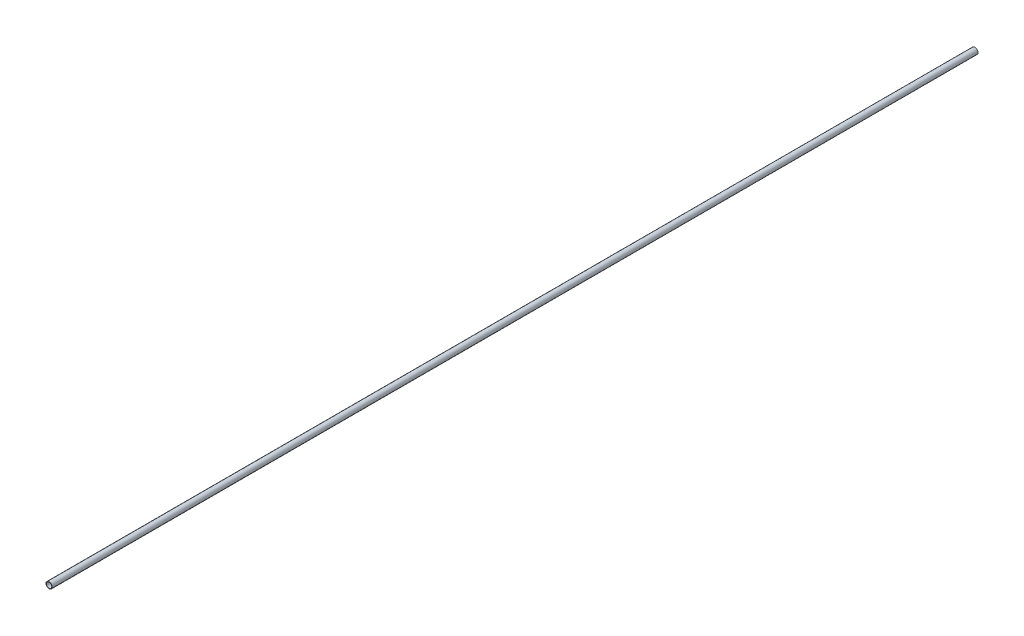
ISO-10303-21;
HEADER;
FILE_DESCRIPTION(('STEP AP214'),'2;1');
FILE_NAME('part.step','',(''),(''),'','','');
FILE_SCHEMA(('AUTOMOTIVE_DESIGN { 1 0 10303 214 1 1 1 1 }'));
ENDSEC;
DATA;
#1=APPLICATION_CONTEXT('core data for automotive mechanical design processes');
#2=APPLICATION_PROTOCOL_DEFINITION('international standard','automotive_design',2000,#1);
#3=PRODUCT_CONTEXT('',#1,'mechanical');
#4=PRODUCT('Part','Part','',(#3));
#5=PRODUCT_RELATED_PRODUCT_CATEGORY('part','',(#4));
#6=PRODUCT_DEFINITION_FORMATION('','',#4);
#7=PRODUCT_DEFINITION_CONTEXT('part definition',#1,'design');
#8=PRODUCT_DEFINITION('design','',#6,#7);
#9=PRODUCT_DEFINITION_SHAPE('','',#8);
#10=(LENGTH_UNIT() NAMED_UNIT(*) SI_UNIT(.MILLI.,.METRE.));
#11=(NAMED_UNIT(*) PLANE_ANGLE_UNIT() SI_UNIT($,.RADIAN.));
#12=(NAMED_UNIT(*) SI_UNIT($,.STERADIAN.) SOLID_ANGLE_UNIT());
#13=UNCERTAINTY_MEASURE_WITH_UNIT(LENGTH_MEASURE(1.E-05),#10,'distance_accuracy_value','');
#14=(GEOMETRIC_REPRESENTATION_CONTEXT(3) GLOBAL_UNCERTAINTY_ASSIGNED_CONTEXT((#13)) GLOBAL_UNIT_ASSIGNED_CONTEXT((#10,
#11,#12)) REPRESENTATION_CONTEXT('',''));
#15=CARTESIAN_POINT('',(0.,0.,0.));
#16=DIRECTION('',(0.,0.,1.));
#17=DIRECTION('',(1.,0.,0.));
#18=AXIS2_PLACEMENT_3D('',#15,#16,#17);
#19=CARTESIAN_POINT('',(0.,0.,1200.));
#20=DIRECTION('',(0.,0.,1.));
#21=DIRECTION('',(1.,0.,0.));
#22=AXIS2_PLACEMENT_3D('',#19,#20,#21);
#23=PLANE('',#22);
#24=CARTESIAN_POINT('',(0.,0.,1200.));
#25=DIRECTION('',(0.,0.,1.));
#26=DIRECTION('',(1.,0.,0.));
#27=AXIS2_PLACEMENT_3D('',#24,#25,#26);
#28=CIRCLE('',#27,4.);
#29=CARTESIAN_POINT('',(4.,0.,1200.));
#30=VERTEX_POINT('',#29);
#31=EDGE_CURVE('E10',#30,#30,#28,.T.);
#32=ORIENTED_EDGE('',*,*,#31,.T.);
#33=EDGE_LOOP('',(#32));
#34=FACE_BOUND('',#33,.T.);
#35=CARTESIAN_POINT('',(0.,0.,1200.));
#36=DIRECTION('',(0.,0.,1.));
#37=DIRECTION('',(1.,0.,0.));
#38=AXIS2_PLACEMENT_3D('',#35,#36,#37);
#39=CIRCLE('',#38,3.5);
#40=CARTESIAN_POINT('',(3.5,0.,1200.));
#41=VERTEX_POINT('',#40);
#42=EDGE_CURVE('E54',#41,#41,#39,.T.);
#43=ORIENTED_EDGE('',*,*,#42,.F.);
#44=EDGE_LOOP('',(#43));
#45=FACE_BOUND('',#44,.T.);
#46=ADVANCED_FACE('F41',(#34,#45),#23,.T.);
#47=CARTESIAN_POINT('',(0.,0.,0.));
#48=DIRECTION('',(0.,0.,1.));
#49=DIRECTION('',(1.,0.,0.));
#50=AXIS2_PLACEMENT_3D('',#47,#48,#49);
#51=PLANE('',#50);
#52=CARTESIAN_POINT('',(0.,0.,0.));
#53=DIRECTION('',(0.,0.,1.));
#54=DIRECTION('',(1.,0.,0.));
#55=AXIS2_PLACEMENT_3D('',#52,#53,#54);
#56=CIRCLE('',#55,4.);
#57=CARTESIAN_POINT('',(4.,0.,0.));
#58=VERTEX_POINT('',#57);
#59=EDGE_CURVE('E45',#58,#58,#56,.T.);
#60=ORIENTED_EDGE('',*,*,#59,.F.);
#61=EDGE_LOOP('',(#60));
#62=FACE_BOUND('',#61,.T.);
#63=CARTESIAN_POINT('',(0.,0.,0.));
#64=DIRECTION('',(0.,0.,1.));
#65=DIRECTION('',(1.,0.,0.));
#66=AXIS2_PLACEMENT_3D('',#63,#64,#65);
#67=CIRCLE('',#66,3.5);
#68=CARTESIAN_POINT('',(3.5,0.,0.));
#69=VERTEX_POINT('',#68);
#70=EDGE_CURVE('E56',#69,#69,#67,.T.);
#71=ORIENTED_EDGE('',*,*,#70,.T.);
#72=EDGE_LOOP('',(#71));
#73=FACE_BOUND('',#72,.T.);
#74=ADVANCED_FACE('F68',(#62,#73),#51,.F.);
#75=CARTESIAN_POINT('',(0.,0.,1200.));
#76=DIRECTION('',(0.,0.,-1.));
#77=DIRECTION('',(-1.,0.,0.));
#78=AXIS2_PLACEMENT_3D('',#75,#76,#77);
#79=CYLINDRICAL_SURFACE('',#78,4.);
#80=ORIENTED_EDGE('',*,*,#31,.F.);
#81=EDGE_LOOP('',(#80));
#82=FACE_BOUND('',#81,.T.);
#83=ORIENTED_EDGE('',*,*,#59,.T.);
#84=EDGE_LOOP('',(#83));
#85=FACE_BOUND('',#84,.T.);
#86=ADVANCED_FACE('F43',(#82,#85),#79,.T.);
#87=CARTESIAN_POINT('',(0.,0.,1200.));
#88=DIRECTION('',(0.,0.,-1.));
#89=DIRECTION('',(-1.,0.,0.));
#90=AXIS2_PLACEMENT_3D('',#87,#88,#89);
#91=CYLINDRICAL_SURFACE('',#90,3.5);
#92=ORIENTED_EDGE('',*,*,#42,.T.);
#93=EDGE_LOOP('',(#92));
#94=FACE_BOUND('',#93,.T.);
#95=ORIENTED_EDGE('',*,*,#70,.F.);
#96=EDGE_LOOP('',(#95));
#97=FACE_BOUND('',#96,.T.);
#98=ADVANCED_FACE('F64',(#94,#97),#91,.F.);
#99=CLOSED_SHELL('',(#46,#74,#86,#98));
#100=MANIFOLD_SOLID_BREP('B2',#99);
#101=ADVANCED_BREP_SHAPE_REPRESENTATION('',(#18,#100),#14);
#102=SHAPE_DEFINITION_REPRESENTATION(#9,#101);
ENDSEC;
END-ISO-10303-21;
